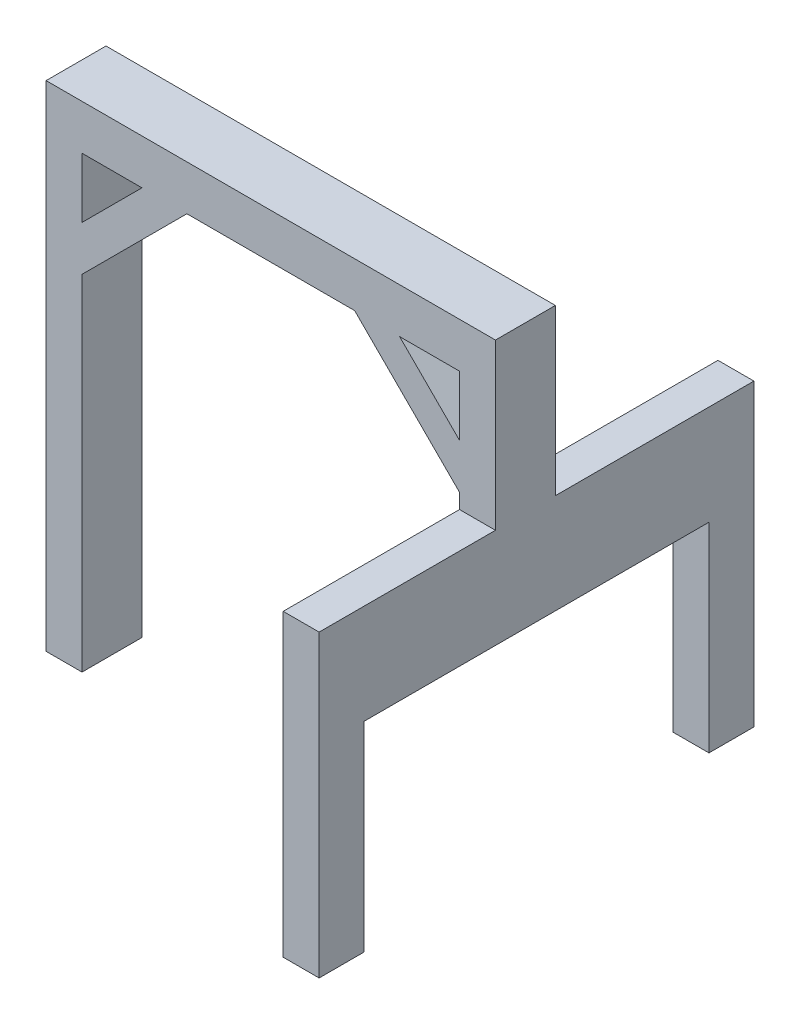
ISO-10303-21;
HEADER;
FILE_DESCRIPTION(('STEP AP214'),'2;1');
FILE_NAME('part.step','',(''),(''),'','','');
FILE_SCHEMA(('AUTOMOTIVE_DESIGN { 1 0 10303 214 1 1 1 1 }'));
ENDSEC;
DATA;
#1=APPLICATION_CONTEXT('core data for automotive mechanical design processes');
#2=APPLICATION_PROTOCOL_DEFINITION('international standard','automotive_design',2000,#1);
#3=PRODUCT_CONTEXT('',#1,'mechanical');
#4=PRODUCT('Part','Part','',(#3));
#5=PRODUCT_RELATED_PRODUCT_CATEGORY('part','',(#4));
#6=PRODUCT_DEFINITION_FORMATION('','',#4);
#7=PRODUCT_DEFINITION_CONTEXT('part definition',#1,'design');
#8=PRODUCT_DEFINITION('design','',#6,#7);
#9=PRODUCT_DEFINITION_SHAPE('','',#8);
#10=(LENGTH_UNIT() NAMED_UNIT(*) SI_UNIT(.MILLI.,.METRE.));
#11=(NAMED_UNIT(*) PLANE_ANGLE_UNIT() SI_UNIT($,.RADIAN.));
#12=(NAMED_UNIT(*) SI_UNIT($,.STERADIAN.) SOLID_ANGLE_UNIT());
#13=UNCERTAINTY_MEASURE_WITH_UNIT(LENGTH_MEASURE(1.E-05),#10,'distance_accuracy_value','');
#14=(GEOMETRIC_REPRESENTATION_CONTEXT(3) GLOBAL_UNCERTAINTY_ASSIGNED_CONTEXT((#13)) GLOBAL_UNIT_ASSIGNED_CONTEXT((#10,
#11,#12)) REPRESENTATION_CONTEXT('',''));
#15=CARTESIAN_POINT('',(0.,0.,0.));
#16=DIRECTION('',(0.,0.,1.));
#17=DIRECTION('',(1.,0.,0.));
#18=AXIS2_PLACEMENT_3D('',#15,#16,#17);
#19=CARTESIAN_POINT('',(43.3570285510321,43.3570285510321,20.));
#20=DIRECTION('',(0.707106781186548,0.707106781186548,0.));
#21=DIRECTION('',(-0.707106781186548,0.707106781186548,0.));
#22=AXIS2_PLACEMENT_3D('',#19,#20,#21);
#23=PLANE('',#22);
#24=DIRECTION('',(0.707106781186548,-0.707106781186548,0.));
#25=VECTOR('',#24,1.);
#26=CARTESIAN_POINT('',(43.3570285510321,43.3570285510321,0.));
#27=LINE('',#26,#25);
#28=CARTESIAN_POINT('',(55.3290471865034,31.3850099155607,0.));
#29=VERTEX_POINT('',#28);
#30=CARTESIAN_POINT('',(75.3290471865034,11.3850099155607,0.));
#31=VERTEX_POINT('',#30);
#32=EDGE_CURVE('E183',#29,#31,#27,.T.);
#33=ORIENTED_EDGE('',*,*,#32,.F.);
#34=DIRECTION('',(0.,0.,-1.));
#35=VECTOR('',#34,1.);
#36=CARTESIAN_POINT('',(55.3290471865034,31.3850099155607,20.));
#37=LINE('',#36,#35);
#38=CARTESIAN_POINT('',(55.3290471865034,31.3850099155607,20.));
#39=VERTEX_POINT('',#38);
#40=EDGE_CURVE('E12',#39,#29,#37,.T.);
#41=ORIENTED_EDGE('',*,*,#40,.F.);
#42=DIRECTION('',(0.707106781186548,-0.707106781186548,0.));
#43=VECTOR('',#42,1.);
#44=CARTESIAN_POINT('',(43.3570285510321,43.3570285510321,20.));
#45=LINE('',#44,#43);
#46=CARTESIAN_POINT('',(75.3290471865034,11.3850099155607,20.));
#47=VERTEX_POINT('',#46);
#48=EDGE_CURVE('E182',#39,#47,#45,.T.);
#49=ORIENTED_EDGE('',*,*,#48,.T.);
#50=DIRECTION('',(0.,0.,-1.));
#51=VECTOR('',#50,1.);
#52=CARTESIAN_POINT('',(75.3290471865034,11.3850099155607,20.));
#53=LINE('',#52,#51);
#54=EDGE_CURVE('E141',#47,#31,#53,.T.);
#55=ORIENTED_EDGE('',*,*,#54,.T.);
#56=EDGE_LOOP('',(#33,#41,#49,#55));
#57=FACE_BOUND('',#56,.T.);
#58=ADVANCED_FACE('F65',(#57),#23,.T.);
#59=CARTESIAN_POINT('',(0.,31.3850099155607,20.));
#60=DIRECTION('',(0.,1.,0.));
#61=DIRECTION('',(0.,0.,1.));
#62=AXIS2_PLACEMENT_3D('',#59,#60,#61);
#63=PLANE('',#62);
#64=DIRECTION('',(1.,0.,0.));
#65=VECTOR('',#64,1.);
#66=CARTESIAN_POINT('',(0.,31.3850099155607,0.));
#67=LINE('',#66,#65);
#68=CARTESIAN_POINT('',(75.3290471865035,31.3850099155607,0.));
#69=VERTEX_POINT('',#68);
#70=EDGE_CURVE('E210',#29,#69,#67,.T.);
#71=ORIENTED_EDGE('',*,*,#70,.T.);
#72=DIRECTION('',(0.,0.,-1.));
#73=VECTOR('',#72,1.);
#74=CARTESIAN_POINT('',(75.3290471865035,31.3850099155607,20.));
#75=LINE('',#74,#73);
#76=CARTESIAN_POINT('',(75.3290471865035,31.3850099155607,20.));
#77=VERTEX_POINT('',#76);
#78=EDGE_CURVE('E75',#77,#69,#75,.T.);
#79=ORIENTED_EDGE('',*,*,#78,.F.);
#80=DIRECTION('',(1.,0.,0.));
#81=VECTOR('',#80,1.);
#82=CARTESIAN_POINT('',(0.,31.3850099155607,20.));
#83=LINE('',#82,#81);
#84=EDGE_CURVE('E187',#39,#77,#83,.T.);
#85=ORIENTED_EDGE('',*,*,#84,.F.);
#86=ORIENTED_EDGE('',*,*,#40,.T.);
#87=EDGE_LOOP('',(#71,#79,#85,#86));
#88=FACE_BOUND('',#87,.T.);
#89=ADVANCED_FACE('F188',(#88),#63,.F.);
#90=CARTESIAN_POINT('',(-31.0279813645286,31.0279813645286,20.));
#91=DIRECTION('',(0.707106781186548,-0.707106781186547,0.));
#92=DIRECTION('',(0.707106781186547,0.707106781186548,0.));
#93=AXIS2_PLACEMENT_3D('',#90,#91,#92);
#94=PLANE('',#93);
#95=DIRECTION('',(-0.707106781186547,-0.707106781186548,0.));
#96=VECTOR('',#95,1.);
#97=CARTESIAN_POINT('',(-31.0279813645286,31.0279813645286,0.));
#98=LINE('',#97,#96);
#99=CARTESIAN_POINT('',(-30.6709528134965,31.3850099155607,0.));
#100=VERTEX_POINT('',#99);
#101=CARTESIAN_POINT('',(-50.6709528134965,11.3850099155607,0.));
#102=VERTEX_POINT('',#101);
#103=EDGE_CURVE('E230',#100,#102,#98,.T.);
#104=ORIENTED_EDGE('',*,*,#103,.T.);
#105=DIRECTION('',(0.,0.,-1.));
#106=VECTOR('',#105,1.);
#107=CARTESIAN_POINT('',(-50.6709528134965,11.3850099155607,20.));
#108=LINE('',#107,#106);
#109=CARTESIAN_POINT('',(-50.6709528134965,11.3850099155607,20.));
#110=VERTEX_POINT('',#109);
#111=EDGE_CURVE('E235',#110,#102,#108,.T.);
#112=ORIENTED_EDGE('',*,*,#111,.F.);
#113=DIRECTION('',(-0.707106781186547,-0.707106781186548,0.));
#114=VECTOR('',#113,1.);
#115=CARTESIAN_POINT('',(-31.0279813645286,31.0279813645286,20.));
#116=LINE('',#115,#114);
#117=CARTESIAN_POINT('',(-30.6709528134965,31.3850099155607,20.));
#118=VERTEX_POINT('',#117);
#119=EDGE_CURVE('E197',#118,#110,#116,.T.);
#120=ORIENTED_EDGE('',*,*,#119,.F.);
#121=DIRECTION('',(0.,0.,-1.));
#122=VECTOR('',#121,1.);
#123=CARTESIAN_POINT('',(-30.6709528134965,31.3850099155607,20.));
#124=LINE('',#123,#122);
#125=EDGE_CURVE('E237',#118,#100,#124,.T.);
#126=ORIENTED_EDGE('',*,*,#125,.T.);
#127=EDGE_LOOP('',(#104,#112,#120,#126));
#128=FACE_BOUND('',#127,.T.);
#129=ADVANCED_FACE('F320',(#128),#94,.F.);
#130=CARTESIAN_POINT('',(-50.6709528134965,0.,20.));
#131=DIRECTION('',(1.,0.,0.));
#132=DIRECTION('',(0.,1.,0.));
#133=AXIS2_PLACEMENT_3D('',#130,#131,#132);
#134=PLANE('',#133);
#135=DIRECTION('',(0.,-1.,0.));
#136=VECTOR('',#135,1.);
#137=CARTESIAN_POINT('',(-50.6709528134965,0.,0.));
#138=LINE('',#137,#136);
#139=CARTESIAN_POINT('',(-50.6709528134965,31.3850099155607,0.));
#140=VERTEX_POINT('',#139);
#141=EDGE_CURVE('E204',#140,#102,#138,.T.);
#142=ORIENTED_EDGE('',*,*,#141,.F.);
#143=DIRECTION('',(0.,0.,-1.));
#144=VECTOR('',#143,1.);
#145=CARTESIAN_POINT('',(-50.6709528134965,31.3850099155607,20.));
#146=LINE('',#145,#144);
#147=CARTESIAN_POINT('',(-50.6709528134965,31.3850099155607,20.));
#148=VERTEX_POINT('',#147);
#149=EDGE_CURVE('E240',#148,#140,#146,.T.);
#150=ORIENTED_EDGE('',*,*,#149,.F.);
#151=DIRECTION('',(0.,-1.,0.));
#152=VECTOR('',#151,1.);
#153=CARTESIAN_POINT('',(-50.6709528134965,0.,20.));
#154=LINE('',#153,#152);
#155=EDGE_CURVE('E194',#148,#110,#154,.T.);
#156=ORIENTED_EDGE('',*,*,#155,.T.);
#157=ORIENTED_EDGE('',*,*,#111,.T.);
#158=EDGE_LOOP('',(#142,#150,#156,#157));
#159=FACE_BOUND('',#158,.T.);
#160=ADVANCED_FACE('F317',(#159),#134,.T.);
#161=CARTESIAN_POINT('',(-50.6709528134965,-3.61499008443929,0.));
#162=VERTEX_POINT('',#161);
#163=CARTESIAN_POINT('',(-50.6709528134965,-118.614990084439,0.));
#164=VERTEX_POINT('',#163);
#165=EDGE_CURVE('E199',#162,#164,#138,.T.);
#166=ORIENTED_EDGE('',*,*,#165,.F.);
#167=DIRECTION('',(0.,0.,-1.));
#168=VECTOR('',#167,1.);
#169=CARTESIAN_POINT('',(-50.6709528134965,-3.61499008443929,20.));
#170=LINE('',#169,#168);
#171=CARTESIAN_POINT('',(-50.6709528134965,-3.61499008443929,20.));
#172=VERTEX_POINT('',#171);
#173=EDGE_CURVE('E69',#172,#162,#170,.T.);
#174=ORIENTED_EDGE('',*,*,#173,.F.);
#175=CARTESIAN_POINT('',(-50.6709528134965,-118.614990084439,20.));
#176=VERTEX_POINT('',#175);
#177=EDGE_CURVE('E307',#172,#176,#154,.T.);
#178=ORIENTED_EDGE('',*,*,#177,.T.);
#179=DIRECTION('',(0.,0.,-1.));
#180=VECTOR('',#179,1.);
#181=CARTESIAN_POINT('',(-50.6709528134965,-118.614990084439,20.));
#182=LINE('',#181,#180);
#183=EDGE_CURVE('E243',#176,#164,#182,.T.);
#184=ORIENTED_EDGE('',*,*,#183,.T.);
#185=EDGE_LOOP('',(#166,#174,#178,#184));
#186=FACE_BOUND('',#185,.T.);
#187=ADVANCED_FACE('F266',(#186),#134,.T.);
#188=CARTESIAN_POINT('',(-23.5279813645286,23.5279813645286,20.));
#189=DIRECTION('',(0.707106781186548,-0.707106781186547,0.));
#190=DIRECTION('',(0.707106781186547,0.707106781186548,0.));
#191=AXIS2_PLACEMENT_3D('',#188,#189,#190);
#192=PLANE('',#191);
#193=DIRECTION('',(-0.707106781186547,-0.707106781186548,0.));
#194=VECTOR('',#193,1.);
#195=CARTESIAN_POINT('',(-23.5279813645286,23.5279813645286,0.));
#196=LINE('',#195,#194);
#197=CARTESIAN_POINT('',(-15.6709528134965,31.3850099155607,0.));
#198=VERTEX_POINT('',#197);
#199=EDGE_CURVE('E202',#198,#162,#196,.T.);
#200=ORIENTED_EDGE('',*,*,#199,.F.);
#201=DIRECTION('',(0.,0.,-1.));
#202=VECTOR('',#201,1.);
#203=CARTESIAN_POINT('',(-15.6709528134965,31.3850099155607,20.));
#204=LINE('',#203,#202);
#205=CARTESIAN_POINT('',(-15.6709528134965,31.3850099155607,20.));
#206=VERTEX_POINT('',#205);
#207=EDGE_CURVE('E257',#206,#198,#204,.T.);
#208=ORIENTED_EDGE('',*,*,#207,.F.);
#209=DIRECTION('',(-0.707106781186547,-0.707106781186548,0.));
#210=VECTOR('',#209,1.);
#211=CARTESIAN_POINT('',(-23.5279813645286,23.5279813645286,20.));
#212=LINE('',#211,#210);
#213=EDGE_CURVE('E265',#206,#172,#212,.T.);
#214=ORIENTED_EDGE('',*,*,#213,.T.);
#215=ORIENTED_EDGE('',*,*,#173,.T.);
#216=EDGE_LOOP('',(#200,#208,#214,#215));
#217=FACE_BOUND('',#216,.T.);
#218=ADVANCED_FACE('F67',(#217),#192,.T.);
#219=CARTESIAN_POINT('',(40.3290471865034,31.3850099155607,0.));
#220=VERTEX_POINT('',#219);
#221=EDGE_CURVE('E207',#198,#220,#67,.T.);
#222=ORIENTED_EDGE('',*,*,#221,.T.);
#223=DIRECTION('',(0.,0.,-1.));
#224=VECTOR('',#223,1.);
#225=CARTESIAN_POINT('',(40.3290471865034,31.3850099155607,20.));
#226=LINE('',#225,#224);
#227=CARTESIAN_POINT('',(40.3290471865034,31.3850099155607,20.));
#228=VERTEX_POINT('',#227);
#229=EDGE_CURVE('E255',#228,#220,#226,.T.);
#230=ORIENTED_EDGE('',*,*,#229,.F.);
#231=EDGE_CURVE('E191',#206,#228,#83,.T.);
#232=ORIENTED_EDGE('',*,*,#231,.F.);
#233=ORIENTED_EDGE('',*,*,#207,.T.);
#234=EDGE_LOOP('',(#222,#230,#232,#233));
#235=FACE_BOUND('',#234,.T.);
#236=ADVANCED_FACE('F275',(#235),#63,.F.);
#237=CARTESIAN_POINT('',(35.8570285510321,35.8570285510321,20.));
#238=DIRECTION('',(0.707106781186548,0.707106781186548,0.));
#239=DIRECTION('',(-0.707106781186548,0.707106781186548,0.));
#240=AXIS2_PLACEMENT_3D('',#237,#238,#239);
#241=PLANE('',#240);
#242=DIRECTION('',(0.707106781186548,-0.707106781186548,0.));
#243=VECTOR('',#242,1.);
#244=CARTESIAN_POINT('',(35.8570285510321,35.8570285510321,0.));
#245=LINE('',#244,#243);
#246=CARTESIAN_POINT('',(75.3290471865035,-3.61499008443935,0.));
#247=VERTEX_POINT('',#246);
#248=EDGE_CURVE('E209',#220,#247,#245,.T.);
#249=ORIENTED_EDGE('',*,*,#248,.T.);
#250=DIRECTION('',(0.,0.,-1.));
#251=VECTOR('',#250,1.);
#252=CARTESIAN_POINT('',(75.3290471865035,-3.61499008443935,20.));
#253=LINE('',#252,#251);
#254=CARTESIAN_POINT('',(75.3290471865035,-3.61499008443935,20.));
#255=VERTEX_POINT('',#254);
#256=EDGE_CURVE('E252',#255,#247,#253,.T.);
#257=ORIENTED_EDGE('',*,*,#256,.F.);
#258=DIRECTION('',(0.707106781186548,-0.707106781186548,0.));
#259=VECTOR('',#258,1.);
#260=CARTESIAN_POINT('',(35.8570285510321,35.8570285510321,20.));
#261=LINE('',#260,#259);
#262=EDGE_CURVE('E280',#228,#255,#261,.T.);
#263=ORIENTED_EDGE('',*,*,#262,.F.);
#264=ORIENTED_EDGE('',*,*,#229,.T.);
#265=EDGE_LOOP('',(#249,#257,#263,#264));
#266=FACE_BOUND('',#265,.T.);
#267=ADVANCED_FACE('F278',(#266),#241,.F.);
#268=CARTESIAN_POINT('',(75.3290471865035,0.,20.));
#269=DIRECTION('',(1.,0.,0.));
#270=DIRECTION('',(0.,1.,0.));
#271=AXIS2_PLACEMENT_3D('',#268,#269,#270);
#272=PLANE('',#271);
#273=DIRECTION('',(0.,-1.,0.));
#274=VECTOR('',#273,1.);
#275=CARTESIAN_POINT('',(75.3290471865035,0.,0.));
#276=LINE('',#275,#274);
#277=CARTESIAN_POINT('',(75.3290471865035,-8.61499008443928,0.));
#278=VERTEX_POINT('',#277);
#279=EDGE_CURVE('E213',#247,#278,#276,.T.);
#280=ORIENTED_EDGE('',*,*,#279,.T.);
#281=DIRECTION('',(0.,0.,-1.));
#282=VECTOR('',#281,1.);
#283=CARTESIAN_POINT('',(75.3290471865035,-8.61499008443928,0.));
#284=LINE('',#283,#282);
#285=CARTESIAN_POINT('',(75.3290471865035,-8.61499008443928,-66.2712722631357));
#286=VERTEX_POINT('',#285);
#287=EDGE_CURVE('E554',#278,#286,#284,.T.);
#288=ORIENTED_EDGE('',*,*,#287,.T.);
#289=DIRECTION('',(0.,-1.,0.));
#290=VECTOR('',#289,1.);
#291=CARTESIAN_POINT('',(75.3290471865035,-8.61499008443928,-66.2712722631357));
#292=LINE('',#291,#290);
#293=CARTESIAN_POINT('',(75.3290471865034,-108.614990084439,-66.2712722631358));
#294=VERTEX_POINT('',#293);
#295=EDGE_CURVE('E589',#286,#294,#292,.T.);
#296=ORIENTED_EDGE('',*,*,#295,.T.);
#297=DIRECTION('',(0.,0.,1.));
#298=VECTOR('',#297,1.);
#299=CARTESIAN_POINT('',(75.3290471865034,-108.614990084439,-66.2712722631358));
#300=LINE('',#299,#298);
#301=CARTESIAN_POINT('',(75.3290471865034,-108.614990084439,-51.2712722631358));
#302=VERTEX_POINT('',#301);
#303=EDGE_CURVE('E534',#294,#302,#300,.T.);
#304=ORIENTED_EDGE('',*,*,#303,.T.);
#305=DIRECTION('',(0.,-1.,0.));
#306=VECTOR('',#305,1.);
#307=CARTESIAN_POINT('',(75.3290471865035,-8.61499008443928,-51.2712722631358));
#308=LINE('',#307,#306);
#309=CARTESIAN_POINT('',(75.3290471865034,-41.9149616857704,-51.2712722631358));
#310=VERTEX_POINT('',#309);
#311=EDGE_CURVE('E516',#310,#302,#308,.T.);
#312=ORIENTED_EDGE('',*,*,#311,.F.);
#313=DIRECTION('',(0.,0.,-1.));
#314=VECTOR('',#313,1.);
#315=CARTESIAN_POINT('',(75.3290471865034,-41.9149616857704,0.));
#316=LINE('',#315,#314);
#317=CARTESIAN_POINT('',(75.3290471865034,-41.9149616857704,63.8587956748827));
#318=VERTEX_POINT('',#317);
#319=EDGE_CURVE('E531',#318,#310,#316,.T.);
#320=ORIENTED_EDGE('',*,*,#319,.F.);
#321=DIRECTION('',(0.,-1.,0.));
#322=VECTOR('',#321,1.);
#323=CARTESIAN_POINT('',(75.3290471865035,0.,63.8587956748827));
#324=LINE('',#323,#322);
#325=CARTESIAN_POINT('',(75.3290471865034,-108.614990084439,63.8587956748827));
#326=VERTEX_POINT('',#325);
#327=EDGE_CURVE('E542',#318,#326,#324,.T.);
#328=ORIENTED_EDGE('',*,*,#327,.T.);
#329=DIRECTION('',(0.,0.,1.));
#330=VECTOR('',#329,1.);
#331=CARTESIAN_POINT('',(75.3290471865034,-108.614990084439,0.));
#332=LINE('',#331,#330);
#333=CARTESIAN_POINT('',(75.3290471865034,-108.614990084439,78.8587956748827));
#334=VERTEX_POINT('',#333);
#335=EDGE_CURVE('E547',#326,#334,#332,.T.);
#336=ORIENTED_EDGE('',*,*,#335,.T.);
#337=DIRECTION('',(0.,-1.,0.));
#338=VECTOR('',#337,1.);
#339=CARTESIAN_POINT('',(75.3290471865035,0.,78.8587956748827));
#340=LINE('',#339,#338);
#341=CARTESIAN_POINT('',(75.3290471865035,-8.61499008443928,78.8587956748827));
#342=VERTEX_POINT('',#341);
#343=EDGE_CURVE('E634',#342,#334,#340,.T.);
#344=ORIENTED_EDGE('',*,*,#343,.F.);
#345=CARTESIAN_POINT('',(75.3290471865035,-8.61499008443928,20.));
#346=VERTEX_POINT('',#345);
#347=EDGE_CURVE('E559',#342,#346,#284,.T.);
#348=ORIENTED_EDGE('',*,*,#347,.T.);
#349=DIRECTION('',(0.,-1.,0.));
#350=VECTOR('',#349,1.);
#351=CARTESIAN_POINT('',(75.3290471865035,0.,20.));
#352=LINE('',#351,#350);
#353=EDGE_CURVE('E284',#255,#346,#352,.T.);
#354=ORIENTED_EDGE('',*,*,#353,.F.);
#355=ORIENTED_EDGE('',*,*,#256,.T.);
#356=EDGE_LOOP('',(#280,#288,#296,#304,#312,#320,#328,#336,#344,#348,#354,#355));
#357=FACE_BOUND('',#356,.T.);
#358=ADVANCED_FACE('F333',(#357),#272,.F.);
#359=CARTESIAN_POINT('',(87.3290471865035,0.,20.));
#360=DIRECTION('',(1.,0.,0.));
#361=DIRECTION('',(0.,1.,0.));
#362=AXIS2_PLACEMENT_3D('',#359,#360,#361);
#363=PLANE('',#362);
#364=DIRECTION('',(0.,-1.,0.));
#365=VECTOR('',#364,1.);
#366=CARTESIAN_POINT('',(87.3290471865035,0.,0.));
#367=LINE('',#366,#365);
#368=CARTESIAN_POINT('',(87.3290471865035,46.3850099155607,0.));
#369=VERTEX_POINT('',#368);
#370=CARTESIAN_POINT('',(87.3290471865035,-8.61499008443928,0.));
#371=VERTEX_POINT('',#370);
#372=EDGE_CURVE('E219',#369,#371,#367,.T.);
#373=ORIENTED_EDGE('',*,*,#372,.F.);
#374=DIRECTION('',(0.,0.,-1.));
#375=VECTOR('',#374,1.);
#376=CARTESIAN_POINT('',(87.3290471865035,46.3850099155607,20.));
#377=LINE('',#376,#375);
#378=CARTESIAN_POINT('',(87.3290471865035,46.3850099155607,20.));
#379=VERTEX_POINT('',#378);
#380=EDGE_CURVE('E250',#379,#369,#377,.T.);
#381=ORIENTED_EDGE('',*,*,#380,.F.);
#382=DIRECTION('',(0.,-1.,0.));
#383=VECTOR('',#382,1.);
#384=CARTESIAN_POINT('',(87.3290471865035,0.,20.));
#385=LINE('',#384,#383);
#386=CARTESIAN_POINT('',(87.3290471865035,-8.61499008443928,20.));
#387=VERTEX_POINT('',#386);
#388=EDGE_CURVE('E292',#379,#387,#385,.T.);
#389=ORIENTED_EDGE('',*,*,#388,.T.);
#390=DIRECTION('',(0.,0.,-1.));
#391=VECTOR('',#390,1.);
#392=CARTESIAN_POINT('',(87.3290471865035,-8.61499008443928,0.));
#393=LINE('',#392,#391);
#394=CARTESIAN_POINT('',(87.3290471865035,-8.61499008443928,78.8587956748827));
#395=VERTEX_POINT('',#394);
#396=EDGE_CURVE('E630',#395,#387,#393,.T.);
#397=ORIENTED_EDGE('',*,*,#396,.F.);
#398=DIRECTION('',(0.,-1.,0.));
#399=VECTOR('',#398,1.);
#400=CARTESIAN_POINT('',(87.3290471865035,0.,78.8587956748827));
#401=LINE('',#400,#399);
#402=CARTESIAN_POINT('',(87.3290471865034,-108.614990084439,78.8587956748827));
#403=VERTEX_POINT('',#402);
#404=EDGE_CURVE('E568',#395,#403,#401,.T.);
#405=ORIENTED_EDGE('',*,*,#404,.T.);
#406=DIRECTION('',(0.,0.,1.));
#407=VECTOR('',#406,1.);
#408=CARTESIAN_POINT('',(87.3290471865034,-108.614990084439,0.));
#409=LINE('',#408,#407);
#410=CARTESIAN_POINT('',(87.3290471865034,-108.614990084439,63.8587956748827));
#411=VERTEX_POINT('',#410);
#412=EDGE_CURVE('E562',#411,#403,#409,.T.);
#413=ORIENTED_EDGE('',*,*,#412,.F.);
#414=DIRECTION('',(0.,-1.,0.));
#415=VECTOR('',#414,1.);
#416=CARTESIAN_POINT('',(87.3290471865035,0.,63.8587956748827));
#417=LINE('',#416,#415);
#418=CARTESIAN_POINT('',(87.3290471865034,-41.9149616857704,63.8587956748827));
#419=VERTEX_POINT('',#418);
#420=EDGE_CURVE('E555',#419,#411,#417,.T.);
#421=ORIENTED_EDGE('',*,*,#420,.F.);
#422=DIRECTION('',(0.,0.,-1.));
#423=VECTOR('',#422,1.);
#424=CARTESIAN_POINT('',(87.3290471865034,-41.9149616857704,0.));
#425=LINE('',#424,#423);
#426=CARTESIAN_POINT('',(87.3290471865034,-41.9149616857704,-51.2712722631358));
#427=VERTEX_POINT('',#426);
#428=EDGE_CURVE('E553',#419,#427,#425,.T.);
#429=ORIENTED_EDGE('',*,*,#428,.T.);
#430=DIRECTION('',(0.,-1.,0.));
#431=VECTOR('',#430,1.);
#432=CARTESIAN_POINT('',(87.3290471865035,-8.61499008443929,-51.2712722631358));
#433=LINE('',#432,#431);
#434=CARTESIAN_POINT('',(87.3290471865034,-108.614990084439,-51.2712722631358));
#435=VERTEX_POINT('',#434);
#436=EDGE_CURVE('E520',#427,#435,#433,.T.);
#437=ORIENTED_EDGE('',*,*,#436,.T.);
#438=DIRECTION('',(0.,0.,1.));
#439=VECTOR('',#438,1.);
#440=CARTESIAN_POINT('',(87.3290471865034,-108.614990084439,-66.2712722631358));
#441=LINE('',#440,#439);
#442=CARTESIAN_POINT('',(87.3290471865034,-108.614990084439,-66.2712722631358));
#443=VERTEX_POINT('',#442);
#444=EDGE_CURVE('E584',#443,#435,#441,.T.);
#445=ORIENTED_EDGE('',*,*,#444,.F.);
#446=DIRECTION('',(0.,-1.,0.));
#447=VECTOR('',#446,1.);
#448=CARTESIAN_POINT('',(87.3290471865035,-8.61499008443928,-66.2712722631357));
#449=LINE('',#448,#447);
#450=CARTESIAN_POINT('',(87.3290471865035,-8.61499008443928,-66.2712722631357));
#451=VERTEX_POINT('',#450);
#452=EDGE_CURVE('E536',#451,#443,#449,.T.);
#453=ORIENTED_EDGE('',*,*,#452,.F.);
#454=EDGE_CURVE('E596',#371,#451,#393,.T.);
#455=ORIENTED_EDGE('',*,*,#454,.F.);
#456=EDGE_LOOP('',(#373,#381,#389,#397,#405,#413,#421,#429,#437,#445,#453,#455));
#457=FACE_BOUND('',#456,.T.);
#458=ADVANCED_FACE('F356',(#457),#363,.T.);
#459=CARTESIAN_POINT('',(0.,46.3850099155607,20.));
#460=DIRECTION('',(0.,1.,0.));
#461=DIRECTION('',(0.,0.,1.));
#462=AXIS2_PLACEMENT_3D('',#459,#460,#461);
#463=PLANE('',#462);
#464=DIRECTION('',(1.,0.,0.));
#465=VECTOR('',#464,1.);
#466=CARTESIAN_POINT('',(0.,46.3850099155607,0.));
#467=LINE('',#466,#465);
#468=CARTESIAN_POINT('',(-62.6709528134965,46.3850099155607,0.));
#469=VERTEX_POINT('',#468);
#470=EDGE_CURVE('E222',#469,#369,#467,.T.);
#471=ORIENTED_EDGE('',*,*,#470,.F.);
#472=DIRECTION('',(0.,0.,-1.));
#473=VECTOR('',#472,1.);
#474=CARTESIAN_POINT('',(-62.6709528134965,46.3850099155607,20.));
#475=LINE('',#474,#473);
#476=CARTESIAN_POINT('',(-62.6709528134965,46.3850099155607,20.));
#477=VERTEX_POINT('',#476);
#478=EDGE_CURVE('E248',#477,#469,#475,.T.);
#479=ORIENTED_EDGE('',*,*,#478,.F.);
#480=DIRECTION('',(1.,0.,0.));
#481=VECTOR('',#480,1.);
#482=CARTESIAN_POINT('',(0.,46.3850099155607,20.));
#483=LINE('',#482,#481);
#484=EDGE_CURVE('E295',#477,#379,#483,.T.);
#485=ORIENTED_EDGE('',*,*,#484,.T.);
#486=ORIENTED_EDGE('',*,*,#380,.T.);
#487=EDGE_LOOP('',(#471,#479,#485,#486));
#488=FACE_BOUND('',#487,.T.);
#489=ADVANCED_FACE('F352',(#488),#463,.T.);
#490=CARTESIAN_POINT('',(-62.6709528134965,0.,20.));
#491=DIRECTION('',(1.,0.,0.));
#492=DIRECTION('',(0.,0.,-1.));
#493=AXIS2_PLACEMENT_3D('',#490,#491,#492);
#494=PLANE('',#493);
#495=DIRECTION('',(0.,-1.,0.));
#496=VECTOR('',#495,1.);
#497=CARTESIAN_POINT('',(-62.6709528134965,0.,0.));
#498=LINE('',#497,#496);
#499=CARTESIAN_POINT('',(-62.6709528134965,-118.614990084439,0.));
#500=VERTEX_POINT('',#499);
#501=EDGE_CURVE('E225',#469,#500,#498,.T.);
#502=ORIENTED_EDGE('',*,*,#501,.T.);
#503=DIRECTION('',(0.,0.,-1.));
#504=VECTOR('',#503,1.);
#505=CARTESIAN_POINT('',(-62.6709528134965,-118.614990084439,20.));
#506=LINE('',#505,#504);
#507=CARTESIAN_POINT('',(-62.6709528134965,-118.614990084439,20.));
#508=VERTEX_POINT('',#507);
#509=EDGE_CURVE('E245',#508,#500,#506,.T.);
#510=ORIENTED_EDGE('',*,*,#509,.F.);
#511=DIRECTION('',(0.,-1.,0.));
#512=VECTOR('',#511,1.);
#513=CARTESIAN_POINT('',(-62.6709528134965,0.,20.));
#514=LINE('',#513,#512);
#515=EDGE_CURVE('E298',#477,#508,#514,.T.);
#516=ORIENTED_EDGE('',*,*,#515,.F.);
#517=ORIENTED_EDGE('',*,*,#478,.T.);
#518=EDGE_LOOP('',(#502,#510,#516,#517));
#519=FACE_BOUND('',#518,.T.);
#520=ADVANCED_FACE('F349',(#519),#494,.F.);
#521=EDGE_CURVE('E211',#140,#100,#67,.T.);
#522=ORIENTED_EDGE('',*,*,#521,.T.);
#523=ORIENTED_EDGE('',*,*,#125,.F.);
#524=EDGE_CURVE('E190',#148,#118,#83,.T.);
#525=ORIENTED_EDGE('',*,*,#524,.F.);
#526=ORIENTED_EDGE('',*,*,#149,.T.);
#527=EDGE_LOOP('',(#522,#523,#525,#526));
#528=FACE_BOUND('',#527,.T.);
#529=ADVANCED_FACE('F321',(#528),#63,.F.);
#530=CARTESIAN_POINT('',(0.,-118.614990084439,20.));
#531=DIRECTION('',(0.,1.,0.));
#532=DIRECTION('',(0.,0.,1.));
#533=AXIS2_PLACEMENT_3D('',#530,#531,#532);
#534=PLANE('',#533);
#535=DIRECTION('',(1.,0.,0.));
#536=VECTOR('',#535,1.);
#537=CARTESIAN_POINT('',(0.,-118.614990084439,0.));
#538=LINE('',#537,#536);
#539=EDGE_CURVE('E227',#500,#164,#538,.T.);
#540=ORIENTED_EDGE('',*,*,#539,.T.);
#541=ORIENTED_EDGE('',*,*,#183,.F.);
#542=DIRECTION('',(1.,0.,0.));
#543=VECTOR('',#542,1.);
#544=CARTESIAN_POINT('',(0.,-118.614990084439,20.));
#545=LINE('',#544,#543);
#546=EDGE_CURVE('E299',#508,#176,#545,.T.);
#547=ORIENTED_EDGE('',*,*,#546,.F.);
#548=ORIENTED_EDGE('',*,*,#509,.T.);
#549=EDGE_LOOP('',(#540,#541,#547,#548));
#550=FACE_BOUND('',#549,.T.);
#551=ADVANCED_FACE('F331',(#550),#534,.F.);
#552=EDGE_CURVE('E134',#69,#31,#276,.T.);
#553=ORIENTED_EDGE('',*,*,#552,.T.);
#554=ORIENTED_EDGE('',*,*,#54,.F.);
#555=EDGE_CURVE('E84',#77,#47,#352,.T.);
#556=ORIENTED_EDGE('',*,*,#555,.F.);
#557=ORIENTED_EDGE('',*,*,#78,.T.);
#558=EDGE_LOOP('',(#553,#554,#556,#557));
#559=FACE_BOUND('',#558,.T.);
#560=ADVANCED_FACE('F323',(#559),#272,.F.);
#561=CARTESIAN_POINT('',(0.,0.,20.));
#562=DIRECTION('',(0.,0.,1.));
#563=DIRECTION('',(1.,0.,0.));
#564=AXIS2_PLACEMENT_3D('',#561,#562,#563);
#565=PLANE('',#564);
#566=ORIENTED_EDGE('',*,*,#177,.F.);
#567=ORIENTED_EDGE('',*,*,#213,.F.);
#568=ORIENTED_EDGE('',*,*,#231,.T.);
#569=ORIENTED_EDGE('',*,*,#262,.T.);
#570=ORIENTED_EDGE('',*,*,#353,.T.);
#571=DIRECTION('',(-1.,0.,0.));
#572=VECTOR('',#571,1.);
#573=CARTESIAN_POINT('',(0.,-8.61499008443928,20.));
#574=LINE('',#573,#572);
#575=EDGE_CURVE('E286',#387,#346,#574,.T.);
#576=ORIENTED_EDGE('',*,*,#575,.F.);
#577=ORIENTED_EDGE('',*,*,#388,.F.);
#578=ORIENTED_EDGE('',*,*,#484,.F.);
#579=ORIENTED_EDGE('',*,*,#515,.T.);
#580=ORIENTED_EDGE('',*,*,#546,.T.);
#581=EDGE_LOOP('',(#566,#567,#568,#569,#570,#576,#577,#578,#579,#580));
#582=FACE_BOUND('',#581,.T.);
#583=ORIENTED_EDGE('',*,*,#119,.T.);
#584=ORIENTED_EDGE('',*,*,#155,.F.);
#585=ORIENTED_EDGE('',*,*,#524,.T.);
#586=EDGE_LOOP('',(#583,#584,#585));
#587=FACE_BOUND('',#586,.T.);
#588=ORIENTED_EDGE('',*,*,#48,.F.);
#589=ORIENTED_EDGE('',*,*,#84,.T.);
#590=ORIENTED_EDGE('',*,*,#555,.T.);
#591=EDGE_LOOP('',(#588,#589,#590));
#592=FACE_BOUND('',#591,.T.);
#593=ADVANCED_FACE('F192',(#582,#587,#592),#565,.T.);
#594=CARTESIAN_POINT('',(0.,0.,0.));
#595=DIRECTION('',(0.,0.,1.));
#596=DIRECTION('',(1.,0.,0.));
#597=AXIS2_PLACEMENT_3D('',#594,#595,#596);
#598=PLANE('',#597);
#599=ORIENTED_EDGE('',*,*,#165,.T.);
#600=ORIENTED_EDGE('',*,*,#539,.F.);
#601=ORIENTED_EDGE('',*,*,#501,.F.);
#602=ORIENTED_EDGE('',*,*,#470,.T.);
#603=ORIENTED_EDGE('',*,*,#372,.T.);
#604=DIRECTION('',(-1.,0.,0.));
#605=VECTOR('',#604,1.);
#606=CARTESIAN_POINT('',(0.,-8.61499008443928,0.));
#607=LINE('',#606,#605);
#608=EDGE_CURVE('E216',#371,#278,#607,.T.);
#609=ORIENTED_EDGE('',*,*,#608,.T.);
#610=ORIENTED_EDGE('',*,*,#279,.F.);
#611=ORIENTED_EDGE('',*,*,#248,.F.);
#612=ORIENTED_EDGE('',*,*,#221,.F.);
#613=ORIENTED_EDGE('',*,*,#199,.T.);
#614=EDGE_LOOP('',(#599,#600,#601,#602,#603,#609,#610,#611,#612,#613));
#615=FACE_BOUND('',#614,.T.);
#616=ORIENTED_EDGE('',*,*,#103,.F.);
#617=ORIENTED_EDGE('',*,*,#521,.F.);
#618=ORIENTED_EDGE('',*,*,#141,.T.);
#619=EDGE_LOOP('',(#616,#617,#618));
#620=FACE_BOUND('',#619,.T.);
#621=ORIENTED_EDGE('',*,*,#32,.T.);
#622=ORIENTED_EDGE('',*,*,#552,.F.);
#623=ORIENTED_EDGE('',*,*,#70,.F.);
#624=EDGE_LOOP('',(#621,#622,#623));
#625=FACE_BOUND('',#624,.T.);
#626=ADVANCED_FACE('F270',(#615,#620,#625),#598,.F.);
#627=CARTESIAN_POINT('',(75.3290471865035,-8.61499008443928,0.));
#628=DIRECTION('',(0.,-1.,0.));
#629=DIRECTION('',(1.,0.,0.));
#630=AXIS2_PLACEMENT_3D('',#627,#628,#629);
#631=PLANE('',#630);
#632=ORIENTED_EDGE('',*,*,#287,.F.);
#633=ORIENTED_EDGE('',*,*,#608,.F.);
#634=ORIENTED_EDGE('',*,*,#454,.T.);
#635=DIRECTION('',(1.,0.,0.));
#636=VECTOR('',#635,1.);
#637=CARTESIAN_POINT('',(75.3290471865035,-8.61499008443928,-66.2712722631357));
#638=LINE('',#637,#636);
#639=EDGE_CURVE('E594',#286,#451,#638,.T.);
#640=ORIENTED_EDGE('',*,*,#639,.F.);
#641=EDGE_LOOP('',(#632,#633,#634,#640));
#642=FACE_BOUND('',#641,.T.);
#643=ADVANCED_FACE('F329',(#642),#631,.F.);
#644=CARTESIAN_POINT('',(75.3290471865034,-108.614990084439,0.));
#645=DIRECTION('',(0.,1.,0.));
#646=DIRECTION('',(-1.,0.,0.));
#647=AXIS2_PLACEMENT_3D('',#644,#645,#646);
#648=PLANE('',#647);
#649=ORIENTED_EDGE('',*,*,#412,.T.);
#650=DIRECTION('',(1.,0.,0.));
#651=VECTOR('',#650,1.);
#652=CARTESIAN_POINT('',(75.3290471865034,-108.614990084439,78.8587956748827));
#653=LINE('',#652,#651);
#654=EDGE_CURVE('E545',#334,#403,#653,.T.);
#655=ORIENTED_EDGE('',*,*,#654,.F.);
#656=ORIENTED_EDGE('',*,*,#335,.F.);
#657=DIRECTION('',(1.,0.,0.));
#658=VECTOR('',#657,1.);
#659=CARTESIAN_POINT('',(75.3290471865034,-108.614990084439,63.8587956748827));
#660=LINE('',#659,#658);
#661=EDGE_CURVE('E574',#326,#411,#660,.T.);
#662=ORIENTED_EDGE('',*,*,#661,.T.);
#663=EDGE_LOOP('',(#649,#655,#656,#662));
#664=FACE_BOUND('',#663,.T.);
#665=ADVANCED_FACE('F422',(#664),#648,.F.);
#666=CARTESIAN_POINT('',(75.3290471865035,0.,78.8587956748827));
#667=DIRECTION('',(0.,0.,1.));
#668=DIRECTION('',(1.,0.,0.));
#669=AXIS2_PLACEMENT_3D('',#666,#667,#668);
#670=PLANE('',#669);
#671=ORIENTED_EDGE('',*,*,#404,.F.);
#672=DIRECTION('',(1.,0.,0.));
#673=VECTOR('',#672,1.);
#674=CARTESIAN_POINT('',(75.3290471865035,-8.61499008443928,78.8587956748827));
#675=LINE('',#674,#673);
#676=EDGE_CURVE('E541',#342,#395,#675,.T.);
#677=ORIENTED_EDGE('',*,*,#676,.F.);
#678=ORIENTED_EDGE('',*,*,#343,.T.);
#679=ORIENTED_EDGE('',*,*,#654,.T.);
#680=EDGE_LOOP('',(#671,#677,#678,#679));
#681=FACE_BOUND('',#680,.T.);
#682=ADVANCED_FACE('F434',(#681),#670,.T.);
#683=CARTESIAN_POINT('',(75.3290471865035,0.,63.8587956748827));
#684=DIRECTION('',(0.,0.,1.));
#685=DIRECTION('',(0.,-1.,0.));
#686=AXIS2_PLACEMENT_3D('',#683,#684,#685);
#687=PLANE('',#686);
#688=ORIENTED_EDGE('',*,*,#420,.T.);
#689=ORIENTED_EDGE('',*,*,#661,.F.);
#690=ORIENTED_EDGE('',*,*,#327,.F.);
#691=DIRECTION('',(1.,0.,0.));
#692=VECTOR('',#691,1.);
#693=CARTESIAN_POINT('',(75.3290471865034,-41.9149616857704,63.8587956748827));
#694=LINE('',#693,#692);
#695=EDGE_CURVE('E527',#318,#419,#694,.T.);
#696=ORIENTED_EDGE('',*,*,#695,.T.);
#697=EDGE_LOOP('',(#688,#689,#690,#696));
#698=FACE_BOUND('',#697,.T.);
#699=ADVANCED_FACE('F444',(#698),#687,.F.);
#700=CARTESIAN_POINT('',(75.3290471865034,-41.9149616857704,0.));
#701=DIRECTION('',(0.,-1.,0.));
#702=DIRECTION('',(1.,0.,0.));
#703=AXIS2_PLACEMENT_3D('',#700,#701,#702);
#704=PLANE('',#703);
#705=ORIENTED_EDGE('',*,*,#428,.F.);
#706=ORIENTED_EDGE('',*,*,#695,.F.);
#707=ORIENTED_EDGE('',*,*,#319,.T.);
#708=DIRECTION('',(1.,0.,0.));
#709=VECTOR('',#708,1.);
#710=CARTESIAN_POINT('',(75.3290471865034,-41.9149616857704,-51.2712722631358));
#711=LINE('',#710,#709);
#712=EDGE_CURVE('E203',#310,#427,#711,.T.);
#713=ORIENTED_EDGE('',*,*,#712,.T.);
#714=EDGE_LOOP('',(#705,#706,#707,#713));
#715=FACE_BOUND('',#714,.T.);
#716=ADVANCED_FACE('F455',(#715),#704,.T.);
#717=ORIENTED_EDGE('',*,*,#575,.T.);
#718=ORIENTED_EDGE('',*,*,#347,.F.);
#719=ORIENTED_EDGE('',*,*,#676,.T.);
#720=ORIENTED_EDGE('',*,*,#396,.T.);
#721=EDGE_LOOP('',(#717,#718,#719,#720));
#722=FACE_BOUND('',#721,.T.);
#723=ADVANCED_FACE('F425',(#722),#631,.F.);
#724=CARTESIAN_POINT('',(75.3290471865035,-8.61499008443928,-66.2712722631357));
#725=DIRECTION('',(0.,0.,1.));
#726=DIRECTION('',(0.,-1.,0.));
#727=AXIS2_PLACEMENT_3D('',#724,#725,#726);
#728=PLANE('',#727);
#729=ORIENTED_EDGE('',*,*,#452,.T.);
#730=DIRECTION('',(1.,0.,0.));
#731=VECTOR('',#730,1.);
#732=CARTESIAN_POINT('',(75.3290471865034,-108.614990084439,-66.2712722631358));
#733=LINE('',#732,#731);
#734=EDGE_CURVE('E597',#294,#443,#733,.T.);
#735=ORIENTED_EDGE('',*,*,#734,.F.);
#736=ORIENTED_EDGE('',*,*,#295,.F.);
#737=ORIENTED_EDGE('',*,*,#639,.T.);
#738=EDGE_LOOP('',(#729,#735,#736,#737));
#739=FACE_BOUND('',#738,.T.);
#740=ADVANCED_FACE('F475',(#739),#728,.F.);
#741=CARTESIAN_POINT('',(75.3290471865034,-108.614990084439,-66.2712722631358));
#742=DIRECTION('',(0.,1.,0.));
#743=DIRECTION('',(0.,0.,1.));
#744=AXIS2_PLACEMENT_3D('',#741,#742,#743);
#745=PLANE('',#744);
#746=ORIENTED_EDGE('',*,*,#444,.T.);
#747=DIRECTION('',(1.,0.,0.));
#748=VECTOR('',#747,1.);
#749=CARTESIAN_POINT('',(75.3290471865034,-108.614990084439,-51.2712722631358));
#750=LINE('',#749,#748);
#751=EDGE_CURVE('E585',#302,#435,#750,.T.);
#752=ORIENTED_EDGE('',*,*,#751,.F.);
#753=ORIENTED_EDGE('',*,*,#303,.F.);
#754=ORIENTED_EDGE('',*,*,#734,.T.);
#755=EDGE_LOOP('',(#746,#752,#753,#754));
#756=FACE_BOUND('',#755,.T.);
#757=ADVANCED_FACE('F486',(#756),#745,.F.);
#758=CARTESIAN_POINT('',(75.3290471865035,-8.61499008443928,-51.2712722631358));
#759=DIRECTION('',(0.,0.,1.));
#760=DIRECTION('',(0.,-1.,0.));
#761=AXIS2_PLACEMENT_3D('',#758,#759,#760);
#762=PLANE('',#761);
#763=ORIENTED_EDGE('',*,*,#712,.F.);
#764=ORIENTED_EDGE('',*,*,#311,.T.);
#765=ORIENTED_EDGE('',*,*,#751,.T.);
#766=ORIENTED_EDGE('',*,*,#436,.F.);
#767=EDGE_LOOP('',(#763,#764,#765,#766));
#768=FACE_BOUND('',#767,.T.);
#769=ADVANCED_FACE('F477',(#768),#762,.T.);
#770=CLOSED_SHELL('',(#58,#89,#129,#160,#187,#218,#236,#267,#358,#458,#489,#520,#529,#551,#560,
#593,#626,#643,#665,#682,#699,#716,#723,#740,#757,#769));
#771=MANIFOLD_SOLID_BREP('B2',#770);
#772=ADVANCED_BREP_SHAPE_REPRESENTATION('',(#18,#771),#14);
#773=SHAPE_DEFINITION_REPRESENTATION(#9,#772);
ENDSEC;
END-ISO-10303-21;
